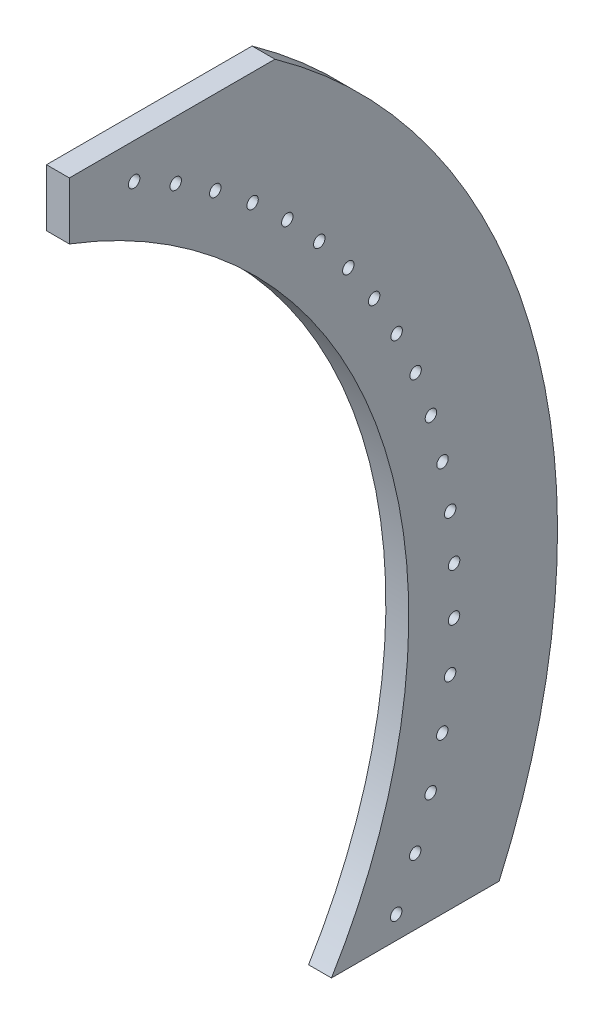
ISO-10303-21;
HEADER;
FILE_DESCRIPTION(('STEP AP214'),'2;1');
FILE_NAME('part.step','',(''),(''),'','','');
FILE_SCHEMA(('AUTOMOTIVE_DESIGN { 1 0 10303 214 1 1 1 1 }'));
ENDSEC;
DATA;
#1=APPLICATION_CONTEXT('core data for automotive mechanical design processes');
#2=APPLICATION_PROTOCOL_DEFINITION('international standard','automotive_design',2000,#1);
#3=PRODUCT_CONTEXT('',#1,'mechanical');
#4=PRODUCT('Part','Part','',(#3));
#5=PRODUCT_RELATED_PRODUCT_CATEGORY('part','',(#4));
#6=PRODUCT_DEFINITION_FORMATION('','',#4);
#7=PRODUCT_DEFINITION_CONTEXT('part definition',#1,'design');
#8=PRODUCT_DEFINITION('design','',#6,#7);
#9=PRODUCT_DEFINITION_SHAPE('','',#8);
#10=(LENGTH_UNIT() NAMED_UNIT(*) SI_UNIT(.MILLI.,.METRE.));
#11=(NAMED_UNIT(*) PLANE_ANGLE_UNIT() SI_UNIT($,.RADIAN.));
#12=(NAMED_UNIT(*) SI_UNIT($,.STERADIAN.) SOLID_ANGLE_UNIT());
#13=UNCERTAINTY_MEASURE_WITH_UNIT(LENGTH_MEASURE(1.E-05),#10,'distance_accuracy_value','');
#14=(GEOMETRIC_REPRESENTATION_CONTEXT(3) GLOBAL_UNCERTAINTY_ASSIGNED_CONTEXT((#13)) GLOBAL_UNIT_ASSIGNED_CONTEXT((#10,
#11,#12)) REPRESENTATION_CONTEXT('',''));
#15=CARTESIAN_POINT('',(0.,0.,0.));
#16=DIRECTION('',(0.,0.,1.));
#17=DIRECTION('',(1.,0.,0.));
#18=AXIS2_PLACEMENT_3D('',#15,#16,#17);
#19=CARTESIAN_POINT('',(12.7,609.6,0.));
#20=DIRECTION('',(0.,-1.,0.));
#21=DIRECTION('',(0.,0.,-1.));
#22=AXIS2_PLACEMENT_3D('',#19,#20,#21);
#23=PLANE('',#22);
#24=DIRECTION('',(1.,0.,0.));
#25=VECTOR('',#24,1.);
#26=CARTESIAN_POINT('',(0.,609.6,-114.092348386149));
#27=LINE('',#26,#25);
#28=CARTESIAN_POINT('',(0.,609.6,-114.092348386149));
#29=VERTEX_POINT('',#28);
#30=CARTESIAN_POINT('',(12.7,609.6,-114.092348386149));
#31=VERTEX_POINT('',#30);
#32=EDGE_CURVE('E91',#29,#31,#27,.T.);
#33=ORIENTED_EDGE('',*,*,#32,.F.);
#34=DIRECTION('',(0.,0.,1.));
#35=VECTOR('',#34,1.);
#36=CARTESIAN_POINT('',(0.,609.6,0.));
#37=LINE('',#36,#35);
#38=CARTESIAN_POINT('',(0.,609.6,0.));
#39=VERTEX_POINT('',#38);
#40=EDGE_CURVE('E98',#29,#39,#37,.T.);
#41=ORIENTED_EDGE('',*,*,#40,.T.);
#42=DIRECTION('',(-1.,0.,0.));
#43=VECTOR('',#42,1.);
#44=CARTESIAN_POINT('',(12.7,609.6,0.));
#45=LINE('',#44,#43);
#46=CARTESIAN_POINT('',(12.7,609.6,0.));
#47=VERTEX_POINT('',#46);
#48=EDGE_CURVE('E149',#47,#39,#45,.T.);
#49=ORIENTED_EDGE('',*,*,#48,.F.);
#50=DIRECTION('',(0.,0.,1.));
#51=VECTOR('',#50,1.);
#52=CARTESIAN_POINT('',(12.7,609.6,0.));
#53=LINE('',#52,#51);
#54=EDGE_CURVE('E152',#31,#47,#53,.T.);
#55=ORIENTED_EDGE('',*,*,#54,.F.);
#56=EDGE_LOOP('',(#33,#41,#49,#55));
#57=FACE_BOUND('',#56,.T.);
#58=ADVANCED_FACE('F38',(#57),#23,.F.);
#59=CARTESIAN_POINT('',(12.7,304.8,103.759854953638));
#60=DIRECTION('',(-1.,0.,0.));
#61=DIRECTION('',(0.,0.,1.));
#62=AXIS2_PLACEMENT_3D('',#59,#60,#61);
#63=PLANE('',#62);
#64=CARTESIAN_POINT('',(12.7,589.914292872178,-35.9401450463644));
#65=DIRECTION('',(1.,0.,0.));
#66=DIRECTION('',(0.,0.,-1.));
#67=AXIS2_PLACEMENT_3D('',#64,#65,#66);
#68=CIRCLE('',#67,3.17500000000004);
#69=CARTESIAN_POINT('',(12.7,589.914292872178,-39.1151450463645));
#70=VERTEX_POINT('',#69);
#71=EDGE_CURVE('E173',#70,#70,#68,.T.);
#72=ORIENTED_EDGE('',*,*,#71,.F.);
#73=EDGE_LOOP('',(#72));
#74=FACE_BOUND('',#73,.T.);
#75=CARTESIAN_POINT('',(12.7,577.404148448489,-59.0075504095873));
#76=DIRECTION('',(1.,0.,0.));
#77=DIRECTION('',(0.,0.,-1.));
#78=AXIS2_PLACEMENT_3D('',#75,#76,#77);
#79=CIRCLE('',#78,3.17500000000004);
#80=CARTESIAN_POINT('',(12.7,577.404148448489,-62.1825504095873));
#81=VERTEX_POINT('',#80);
#82=EDGE_CURVE('E181',#81,#81,#79,.T.);
#83=ORIENTED_EDGE('',*,*,#82,.F.);
#84=EDGE_LOOP('',(#83));
#85=FACE_BOUND('',#84,.T.);
#86=CARTESIAN_POINT('',(12.7,563.031841273928,-80.9630893502014));
#87=DIRECTION('',(1.,0.,0.));
#88=DIRECTION('',(0.,0.,-1.));
#89=AXIS2_PLACEMENT_3D('',#86,#87,#88);
#90=CIRCLE('',#89,3.17500000000004);
#91=CARTESIAN_POINT('',(12.7,563.031841273928,-84.1380893502015));
#92=VERTEX_POINT('',#91);
#93=EDGE_CURVE('E189',#92,#92,#90,.T.);
#94=ORIENTED_EDGE('',*,*,#93,.F.);
#95=EDGE_LOOP('',(#94));
#96=FACE_BOUND('',#95,.T.);
#97=CARTESIAN_POINT('',(12.7,546.895548779823,-101.656783274619));
#98=DIRECTION('',(1.,0.,0.));
#99=DIRECTION('',(0.,0.,-1.));
#100=AXIS2_PLACEMENT_3D('',#97,#98,#99);
#101=CIRCLE('',#100,3.17500000000004);
#102=CARTESIAN_POINT('',(12.7,546.895548779823,-104.831783274619));
#103=VERTEX_POINT('',#102);
#104=EDGE_CURVE('E197',#103,#103,#101,.T.);
#105=ORIENTED_EDGE('',*,*,#104,.F.);
#106=EDGE_LOOP('',(#105));
#107=FACE_BOUND('',#106,.T.);
#108=CARTESIAN_POINT('',(12.7,529.105498205895,-120.947273270207));
#109=DIRECTION('',(1.,0.,0.));
#110=DIRECTION('',(0.,0.,-1.));
#111=AXIS2_PLACEMENT_3D('',#108,#109,#110);
#112=CIRCLE('',#111,3.17500000000004);
#113=CARTESIAN_POINT('',(12.7,529.105498205895,-124.122273270207));
#114=VERTEX_POINT('',#113);
#115=EDGE_CURVE('E205',#114,#114,#112,.T.);
#116=ORIENTED_EDGE('',*,*,#115,.F.);
#117=EDGE_LOOP('',(#116));
#118=FACE_BOUND('',#117,.T.);
#119=CARTESIAN_POINT('',(12.7,509.783213636438,-138.702785729995));
#120=DIRECTION('',(1.,0.,0.));
#121=DIRECTION('',(0.,0.,-1.));
#122=AXIS2_PLACEMENT_3D('',#119,#120,#121);
#123=CIRCLE('',#122,3.17500000000004);
#124=CARTESIAN_POINT('',(12.7,509.783213636438,-141.877785729995));
#125=VERTEX_POINT('',#124);
#126=EDGE_CURVE('E213',#125,#125,#123,.T.);
#127=ORIENTED_EDGE('',*,*,#126,.F.);
#128=EDGE_LOOP('',(#127));
#129=FACE_BOUND('',#128,.T.);
#130=CARTESIAN_POINT('',(12.7,489.0606858676,-154.802032500031));
#131=DIRECTION('',(1.,0.,0.));
#132=DIRECTION('',(0.,0.,-1.));
#133=AXIS2_PLACEMENT_3D('',#130,#131,#132);
#134=CIRCLE('',#133,3.17499999999998);
#135=CARTESIAN_POINT('',(12.7,489.0606858676,-157.977032500031));
#136=VERTEX_POINT('',#135);
#137=EDGE_CURVE('E221',#136,#136,#134,.T.);
#138=ORIENTED_EDGE('',*,*,#137,.F.);
#139=EDGE_LOOP('',(#138));
#140=FACE_BOUND('',#139,.T.);
#141=CARTESIAN_POINT('',(12.7,467.079470776408,-169.135039400454));
#142=DIRECTION('',(1.,0.,0.));
#143=DIRECTION('',(0.,0.,-1.));
#144=AXIS2_PLACEMENT_3D('',#141,#142,#143);
#145=CIRCLE('',#144,3.17499999999998);
#146=CARTESIAN_POINT('',(12.7,467.079470776408,-172.310039400454));
#147=VERTEX_POINT('',#146);
#148=EDGE_CURVE('E229',#147,#147,#145,.T.);
#149=ORIENTED_EDGE('',*,*,#148,.F.);
#150=EDGE_LOOP('',(#149));
#151=FACE_BOUND('',#150,.T.);
#152=CARTESIAN_POINT('',(12.7,443.989722350595,-181.603897460655));
#153=DIRECTION('',(1.,0.,0.));
#154=DIRECTION('',(0.,0.,-1.));
#155=AXIS2_PLACEMENT_3D('',#152,#153,#154);
#156=CIRCLE('',#155,3.17499999999998);
#157=CARTESIAN_POINT('',(12.7,443.989722350595,-184.778897460655));
#158=VERTEX_POINT('',#157);
#159=EDGE_CURVE('E237',#158,#158,#156,.T.);
#160=ORIENTED_EDGE('',*,*,#159,.F.);
#161=EDGE_LOOP('',(#160));
#162=FACE_BOUND('',#161,.T.);
#163=CARTESIAN_POINT('',(12.7,419.949166984606,-192.123431736829));
#164=DIRECTION('',(1.,0.,0.));
#165=DIRECTION('',(0.,0.,-1.));
#166=AXIS2_PLACEMENT_3D('',#163,#164,#165);
#167=CIRCLE('',#166,3.17499999999998);
#168=CARTESIAN_POINT('',(12.7,419.949166984606,-195.298431736829));
#169=VERTEX_POINT('',#168);
#170=EDGE_CURVE('E245',#169,#169,#167,.T.);
#171=ORIENTED_EDGE('',*,*,#170,.F.);
#172=EDGE_LOOP('',(#171));
#173=FACE_BOUND('',#172,.T.);
#174=CARTESIAN_POINT('',(12.7,395.122026048393,-200.621783143201));
#175=DIRECTION('',(1.,0.,0.));
#176=DIRECTION('',(0.,0.,-1.));
#177=AXIS2_PLACEMENT_3D('',#174,#175,#176);
#178=CIRCLE('',#177,3.17499999999998);
#179=CARTESIAN_POINT('',(12.7,395.122026048393,-203.796783143201));
#180=VERTEX_POINT('',#179);
#181=EDGE_CURVE('E253',#180,#180,#178,.T.);
#182=ORIENTED_EDGE('',*,*,#181,.F.);
#183=EDGE_LOOP('',(#182));
#184=FACE_BOUND('',#183,.T.);
#185=CARTESIAN_POINT('',(12.7,369.677894088939,-207.040899322451));
#186=DIRECTION('',(1.,0.,0.));
#187=DIRECTION('',(0.,0.,-1.));
#188=AXIS2_PLACEMENT_3D('',#185,#186,#187);
#189=CIRCLE('',#188,3.17499999999998);
#190=CARTESIAN_POINT('',(12.7,369.677894088939,-210.215899322451));
#191=VERTEX_POINT('',#190);
#192=EDGE_CURVE('E261',#191,#191,#189,.T.);
#193=ORIENTED_EDGE('',*,*,#192,.F.);
#194=EDGE_LOOP('',(#193));
#195=FACE_BOUND('',#194,.T.);
#196=CARTESIAN_POINT('',(12.7,343.790580327539,-211.336931202176));
#197=DIRECTION('',(1.,0.,0.));
#198=DIRECTION('',(0.,0.,-1.));
#199=AXIS2_PLACEMENT_3D('',#196,#197,#198);
#200=CIRCLE('',#199,3.17499999999998);
#201=CARTESIAN_POINT('',(12.7,343.790580327539,-214.511931202176));
#202=VERTEX_POINT('',#201);
#203=EDGE_CURVE('E269',#202,#202,#200,.T.);
#204=ORIENTED_EDGE('',*,*,#203,.F.);
#205=EDGE_LOOP('',(#204));
#206=FACE_BOUND('',#205,.T.);
#207=CARTESIAN_POINT('',(12.7,317.636921366574,-213.480532528519));
#208=DIRECTION('',(1.,0.,0.));
#209=DIRECTION('',(0.,0.,-1.));
#210=AXIS2_PLACEMENT_3D('',#207,#208,#209);
#211=CIRCLE('',#210,3.17499999999998);
#212=CARTESIAN_POINT('',(12.7,317.636921366574,-216.655532528519));
#213=VERTEX_POINT('',#212);
#214=EDGE_CURVE('E277',#213,#213,#211,.T.);
#215=ORIENTED_EDGE('',*,*,#214,.F.);
#216=EDGE_LOOP('',(#215));
#217=FACE_BOUND('',#216,.T.);
#218=CARTESIAN_POINT('',(12.7,291.395573216208,-213.457060330839));
#219=DIRECTION('',(1.,0.,0.));
#220=DIRECTION('',(0.,0.,-1.));
#221=AXIS2_PLACEMENT_3D('',#218,#219,#220);
#222=CIRCLE('',#221,3.17499999999998);
#223=CARTESIAN_POINT('',(12.7,291.395573216208,-216.632060330839));
#224=VERTEX_POINT('',#223);
#225=EDGE_CURVE('E285',#224,#224,#222,.T.);
#226=ORIENTED_EDGE('',*,*,#225,.F.);
#227=EDGE_LOOP('',(#226));
#228=FACE_BOUND('',#227,.T.);
#229=CARTESIAN_POINT('',(12.7,265.245790892685,-211.266674948044));
#230=DIRECTION('',(1.,0.,0.));
#231=DIRECTION('',(0.,0.,-1.));
#232=AXIS2_PLACEMENT_3D('',#229,#230,#231);
#233=CIRCLE('',#232,3.17499999999998);
#234=CARTESIAN_POINT('',(12.7,265.245790892685,-214.441674948044));
#235=VERTEX_POINT('',#234);
#236=EDGE_CURVE('E293',#235,#235,#233,.T.);
#237=ORIENTED_EDGE('',*,*,#236,.F.);
#238=EDGE_LOOP('',(#237));
#239=FACE_BOUND('',#238,.T.);
#240=CARTESIAN_POINT('',(12.7,239.366203924806,-206.924338933322));
#241=DIRECTION('',(1.,0.,0.));
#242=DIRECTION('',(0.,0.,-1.));
#243=AXIS2_PLACEMENT_3D('',#240,#241,#242);
#244=CIRCLE('',#243,3.17500000000001);
#245=CARTESIAN_POINT('',(12.7,239.366203924806,-210.099338933322));
#246=VERTEX_POINT('',#245);
#247=EDGE_CURVE('E301',#246,#246,#244,.T.);
#248=ORIENTED_EDGE('',*,*,#247,.F.);
#249=EDGE_LOOP('',(#248));
#250=FACE_BOUND('',#249,.T.);
#251=CARTESIAN_POINT('',(12.7,213.933596133116,-200.459714844725));
#252=DIRECTION('',(1.,0.,0.));
#253=DIRECTION('',(0.,0.,-1.));
#254=AXIS2_PLACEMENT_3D('',#251,#252,#253);
#255=CIRCLE('',#254,3.17500000000001);
#256=CARTESIAN_POINT('',(12.7,213.933596133116,-203.634714844725));
#257=VERTEX_POINT('',#256);
#258=EDGE_CURVE('E309',#257,#257,#255,.T.);
#259=ORIENTED_EDGE('',*,*,#258,.F.);
#260=EDGE_LOOP('',(#259));
#261=FACE_BOUND('',#260,.T.);
#262=CARTESIAN_POINT('',(12.7,189.121698017159,-191.916962619818));
#263=DIRECTION('',(1.,0.,0.));
#264=DIRECTION('',(0.,0.,-1.));
#265=AXIS2_PLACEMENT_3D('',#262,#263,#264);
#266=CIRCLE('',#265,3.17500000000001);
#267=CARTESIAN_POINT('',(12.7,189.121698017159,-195.091962619818));
#268=VERTEX_POINT('',#267);
#269=EDGE_CURVE('E317',#268,#268,#266,.T.);
#270=ORIENTED_EDGE('',*,*,#269,.F.);
#271=EDGE_LOOP('',(#270));
#272=FACE_BOUND('',#271,.T.);
#273=CARTESIAN_POINT('',(12.7,165.1,-181.354437918536));
#274=DIRECTION('',(1.,0.,0.));
#275=DIRECTION('',(0.,0.,-1.));
#276=AXIS2_PLACEMENT_3D('',#273,#274,#275);
#277=CIRCLE('',#276,3.17500000000001);
#278=CARTESIAN_POINT('',(12.7,165.1,-184.529437918536));
#279=VERTEX_POINT('',#278);
#280=EDGE_CURVE('E90',#279,#279,#277,.T.);
#281=ORIENTED_EDGE('',*,*,#280,.F.);
#282=EDGE_LOOP('',(#281));
#283=FACE_BOUND('',#282,.T.);
#284=CARTESIAN_POINT('',(12.7,304.8,103.759854953638));
#285=DIRECTION('',(1.,0.,0.));
#286=DIRECTION('',(0.,0.,-1.));
#287=AXIS2_PLACEMENT_3D('',#284,#285,#286);
#288=CIRCLE('',#287,374.65);
#289=CARTESIAN_POINT('',(12.7,152.4,-238.492774692943));
#290=VERTEX_POINT('',#289);
#291=EDGE_CURVE('E54',#290,#31,#288,.T.);
#292=ORIENTED_EDGE('',*,*,#291,.T.);
#293=ORIENTED_EDGE('',*,*,#54,.T.);
#294=DIRECTION('',(0.,-1.,0.));
#295=VECTOR('',#294,1.);
#296=CARTESIAN_POINT('',(12.7,609.6,0.));
#297=LINE('',#296,#295);
#298=CARTESIAN_POINT('',(12.7,577.85,0.));
#299=VERTEX_POINT('',#298);
#300=EDGE_CURVE('E144',#47,#299,#297,.T.);
#301=ORIENTED_EDGE('',*,*,#300,.T.);
#302=CARTESIAN_POINT('',(12.7,304.8,103.759854953638));
#303=DIRECTION('',(-1.,0.,0.));
#304=DIRECTION('',(0.,0.,1.));
#305=AXIS2_PLACEMENT_3D('',#302,#303,#304);
#306=CIRCLE('',#305,292.1);
#307=CARTESIAN_POINT('',(12.7,152.4,-145.432139299789));
#308=VERTEX_POINT('',#307);
#309=EDGE_CURVE('E156',#299,#308,#306,.T.);
#310=ORIENTED_EDGE('',*,*,#309,.T.);
#311=DIRECTION('',(0.,0.,1.));
#312=VECTOR('',#311,1.);
#313=CARTESIAN_POINT('',(12.7,152.4,233.500231465649));
#314=LINE('',#313,#312);
#315=EDGE_CURVE('E166',#290,#308,#314,.T.);
#316=ORIENTED_EDGE('',*,*,#315,.F.);
#317=EDGE_LOOP('',(#292,#293,#301,#310,#316));
#318=FACE_BOUND('',#317,.T.);
#319=ADVANCED_FACE('F111',(#74,#85,#96,#107,#118,#129,#140,#151,#162,#173,#184,#195,#206,#217,
#228,#239,#250,#261,#272,#283,#318),#63,.F.);
#320=CARTESIAN_POINT('',(0.,304.8,103.759854953638));
#321=DIRECTION('',(-1.,0.,0.));
#322=DIRECTION('',(0.,0.,1.));
#323=AXIS2_PLACEMENT_3D('',#320,#321,#322);
#324=PLANE('',#323);
#325=CARTESIAN_POINT('',(0.,165.1,-181.354437918536));
#326=DIRECTION('',(1.,0.,0.));
#327=DIRECTION('',(0.,0.,-1.));
#328=AXIS2_PLACEMENT_3D('',#325,#326,#327);
#329=CIRCLE('',#328,3.17499999999998);
#330=CARTESIAN_POINT('',(0.,165.1,-184.529437918536));
#331=VERTEX_POINT('',#330);
#332=EDGE_CURVE('E321',#331,#331,#329,.T.);
#333=ORIENTED_EDGE('',*,*,#332,.T.);
#334=EDGE_LOOP('',(#333));
#335=FACE_BOUND('',#334,.T.);
#336=CARTESIAN_POINT('',(0.,189.121698017159,-191.916962619818));
#337=DIRECTION('',(1.,0.,0.));
#338=DIRECTION('',(0.,0.,-1.));
#339=AXIS2_PLACEMENT_3D('',#336,#337,#338);
#340=CIRCLE('',#339,3.17499999999998);
#341=CARTESIAN_POINT('',(0.,189.121698017159,-195.091962619818));
#342=VERTEX_POINT('',#341);
#343=EDGE_CURVE('E313',#342,#342,#340,.T.);
#344=ORIENTED_EDGE('',*,*,#343,.T.);
#345=EDGE_LOOP('',(#344));
#346=FACE_BOUND('',#345,.T.);
#347=CARTESIAN_POINT('',(0.,213.933596133116,-200.459714844725));
#348=DIRECTION('',(1.,0.,0.));
#349=DIRECTION('',(0.,0.,-1.));
#350=AXIS2_PLACEMENT_3D('',#347,#348,#349);
#351=CIRCLE('',#350,3.17499999999998);
#352=CARTESIAN_POINT('',(0.,213.933596133116,-203.634714844725));
#353=VERTEX_POINT('',#352);
#354=EDGE_CURVE('E305',#353,#353,#351,.T.);
#355=ORIENTED_EDGE('',*,*,#354,.T.);
#356=EDGE_LOOP('',(#355));
#357=FACE_BOUND('',#356,.T.);
#358=CARTESIAN_POINT('',(0.,239.366203924806,-206.924338933322));
#359=DIRECTION('',(1.,0.,0.));
#360=DIRECTION('',(0.,0.,-1.));
#361=AXIS2_PLACEMENT_3D('',#358,#359,#360);
#362=CIRCLE('',#361,3.17499999999998);
#363=CARTESIAN_POINT('',(0.,239.366203924806,-210.099338933322));
#364=VERTEX_POINT('',#363);
#365=EDGE_CURVE('E297',#364,#364,#362,.T.);
#366=ORIENTED_EDGE('',*,*,#365,.T.);
#367=EDGE_LOOP('',(#366));
#368=FACE_BOUND('',#367,.T.);
#369=CARTESIAN_POINT('',(0.,265.245790892685,-211.266674948044));
#370=DIRECTION('',(1.,0.,0.));
#371=DIRECTION('',(0.,0.,-1.));
#372=AXIS2_PLACEMENT_3D('',#369,#370,#371);
#373=CIRCLE('',#372,3.17499999999998);
#374=CARTESIAN_POINT('',(0.,265.245790892685,-214.441674948044));
#375=VERTEX_POINT('',#374);
#376=EDGE_CURVE('E289',#375,#375,#373,.T.);
#377=ORIENTED_EDGE('',*,*,#376,.T.);
#378=EDGE_LOOP('',(#377));
#379=FACE_BOUND('',#378,.T.);
#380=CARTESIAN_POINT('',(0.,291.395573216208,-213.457060330839));
#381=DIRECTION('',(1.,0.,0.));
#382=DIRECTION('',(0.,0.,-1.));
#383=AXIS2_PLACEMENT_3D('',#380,#381,#382);
#384=CIRCLE('',#383,3.17499999999998);
#385=CARTESIAN_POINT('',(0.,291.395573216208,-216.632060330839));
#386=VERTEX_POINT('',#385);
#387=EDGE_CURVE('E281',#386,#386,#384,.T.);
#388=ORIENTED_EDGE('',*,*,#387,.T.);
#389=EDGE_LOOP('',(#388));
#390=FACE_BOUND('',#389,.T.);
#391=CARTESIAN_POINT('',(0.,317.636921366574,-213.480532528519));
#392=DIRECTION('',(1.,0.,0.));
#393=DIRECTION('',(0.,0.,-1.));
#394=AXIS2_PLACEMENT_3D('',#391,#392,#393);
#395=CIRCLE('',#394,3.17499999999998);
#396=CARTESIAN_POINT('',(0.,317.636921366574,-216.655532528519));
#397=VERTEX_POINT('',#396);
#398=EDGE_CURVE('E273',#397,#397,#395,.T.);
#399=ORIENTED_EDGE('',*,*,#398,.T.);
#400=EDGE_LOOP('',(#399));
#401=FACE_BOUND('',#400,.T.);
#402=CARTESIAN_POINT('',(0.,343.790580327539,-211.336931202176));
#403=DIRECTION('',(1.,0.,0.));
#404=DIRECTION('',(0.,0.,-1.));
#405=AXIS2_PLACEMENT_3D('',#402,#403,#404);
#406=CIRCLE('',#405,3.17499999999998);
#407=CARTESIAN_POINT('',(0.,343.790580327539,-214.511931202176));
#408=VERTEX_POINT('',#407);
#409=EDGE_CURVE('E265',#408,#408,#406,.T.);
#410=ORIENTED_EDGE('',*,*,#409,.T.);
#411=EDGE_LOOP('',(#410));
#412=FACE_BOUND('',#411,.T.);
#413=CARTESIAN_POINT('',(0.,369.677894088939,-207.040899322451));
#414=DIRECTION('',(1.,0.,0.));
#415=DIRECTION('',(0.,0.,-1.));
#416=AXIS2_PLACEMENT_3D('',#413,#414,#415);
#417=CIRCLE('',#416,3.17499999999998);
#418=CARTESIAN_POINT('',(0.,369.677894088939,-210.215899322451));
#419=VERTEX_POINT('',#418);
#420=EDGE_CURVE('E257',#419,#419,#417,.T.);
#421=ORIENTED_EDGE('',*,*,#420,.T.);
#422=EDGE_LOOP('',(#421));
#423=FACE_BOUND('',#422,.T.);
#424=CARTESIAN_POINT('',(0.,395.122026048393,-200.621783143201));
#425=DIRECTION('',(1.,0.,0.));
#426=DIRECTION('',(0.,0.,-1.));
#427=AXIS2_PLACEMENT_3D('',#424,#425,#426);
#428=CIRCLE('',#427,3.17499999999998);
#429=CARTESIAN_POINT('',(0.,395.122026048393,-203.796783143201));
#430=VERTEX_POINT('',#429);
#431=EDGE_CURVE('E249',#430,#430,#428,.T.);
#432=ORIENTED_EDGE('',*,*,#431,.T.);
#433=EDGE_LOOP('',(#432));
#434=FACE_BOUND('',#433,.T.);
#435=CARTESIAN_POINT('',(0.,419.949166984606,-192.123431736829));
#436=DIRECTION('',(1.,0.,0.));
#437=DIRECTION('',(0.,0.,-1.));
#438=AXIS2_PLACEMENT_3D('',#435,#436,#437);
#439=CIRCLE('',#438,3.17499999999998);
#440=CARTESIAN_POINT('',(0.,419.949166984606,-195.298431736829));
#441=VERTEX_POINT('',#440);
#442=EDGE_CURVE('E241',#441,#441,#439,.T.);
#443=ORIENTED_EDGE('',*,*,#442,.T.);
#444=EDGE_LOOP('',(#443));
#445=FACE_BOUND('',#444,.T.);
#446=CARTESIAN_POINT('',(0.,443.989722350595,-181.603897460655));
#447=DIRECTION('',(1.,0.,0.));
#448=DIRECTION('',(0.,0.,-1.));
#449=AXIS2_PLACEMENT_3D('',#446,#447,#448);
#450=CIRCLE('',#449,3.17499999999998);
#451=CARTESIAN_POINT('',(0.,443.989722350595,-184.778897460655));
#452=VERTEX_POINT('',#451);
#453=EDGE_CURVE('E233',#452,#452,#450,.T.);
#454=ORIENTED_EDGE('',*,*,#453,.T.);
#455=EDGE_LOOP('',(#454));
#456=FACE_BOUND('',#455,.T.);
#457=CARTESIAN_POINT('',(0.,467.079470776408,-169.135039400454));
#458=DIRECTION('',(1.,0.,0.));
#459=DIRECTION('',(0.,0.,-1.));
#460=AXIS2_PLACEMENT_3D('',#457,#458,#459);
#461=CIRCLE('',#460,3.17499999999998);
#462=CARTESIAN_POINT('',(0.,467.079470776408,-172.310039400454));
#463=VERTEX_POINT('',#462);
#464=EDGE_CURVE('E225',#463,#463,#461,.T.);
#465=ORIENTED_EDGE('',*,*,#464,.T.);
#466=EDGE_LOOP('',(#465));
#467=FACE_BOUND('',#466,.T.);
#468=CARTESIAN_POINT('',(0.,489.0606858676,-154.802032500031));
#469=DIRECTION('',(1.,0.,0.));
#470=DIRECTION('',(0.,0.,-1.));
#471=AXIS2_PLACEMENT_3D('',#468,#469,#470);
#472=CIRCLE('',#471,3.17499999999998);
#473=CARTESIAN_POINT('',(0.,489.0606858676,-157.977032500031));
#474=VERTEX_POINT('',#473);
#475=EDGE_CURVE('E217',#474,#474,#472,.T.);
#476=ORIENTED_EDGE('',*,*,#475,.T.);
#477=EDGE_LOOP('',(#476));
#478=FACE_BOUND('',#477,.T.);
#479=CARTESIAN_POINT('',(0.,509.783213636438,-138.702785729995));
#480=DIRECTION('',(1.,0.,0.));
#481=DIRECTION('',(0.,0.,-1.));
#482=AXIS2_PLACEMENT_3D('',#479,#480,#481);
#483=CIRCLE('',#482,3.17500000000004);
#484=CARTESIAN_POINT('',(0.,509.783213636438,-141.877785729995));
#485=VERTEX_POINT('',#484);
#486=EDGE_CURVE('E209',#485,#485,#483,.T.);
#487=ORIENTED_EDGE('',*,*,#486,.T.);
#488=EDGE_LOOP('',(#487));
#489=FACE_BOUND('',#488,.T.);
#490=CARTESIAN_POINT('',(0.,529.105498205895,-120.947273270207));
#491=DIRECTION('',(1.,0.,0.));
#492=DIRECTION('',(0.,0.,-1.));
#493=AXIS2_PLACEMENT_3D('',#490,#491,#492);
#494=CIRCLE('',#493,3.17500000000004);
#495=CARTESIAN_POINT('',(0.,529.105498205895,-124.122273270207));
#496=VERTEX_POINT('',#495);
#497=EDGE_CURVE('E201',#496,#496,#494,.T.);
#498=ORIENTED_EDGE('',*,*,#497,.T.);
#499=EDGE_LOOP('',(#498));
#500=FACE_BOUND('',#499,.T.);
#501=CARTESIAN_POINT('',(0.,546.895548779823,-101.656783274619));
#502=DIRECTION('',(1.,0.,0.));
#503=DIRECTION('',(0.,0.,-1.));
#504=AXIS2_PLACEMENT_3D('',#501,#502,#503);
#505=CIRCLE('',#504,3.17500000000004);
#506=CARTESIAN_POINT('',(0.,546.895548779823,-104.831783274619));
#507=VERTEX_POINT('',#506);
#508=EDGE_CURVE('E193',#507,#507,#505,.T.);
#509=ORIENTED_EDGE('',*,*,#508,.T.);
#510=EDGE_LOOP('',(#509));
#511=FACE_BOUND('',#510,.T.);
#512=CARTESIAN_POINT('',(0.,563.031841273928,-80.9630893502014));
#513=DIRECTION('',(1.,0.,0.));
#514=DIRECTION('',(0.,0.,-1.));
#515=AXIS2_PLACEMENT_3D('',#512,#513,#514);
#516=CIRCLE('',#515,3.17500000000004);
#517=CARTESIAN_POINT('',(0.,563.031841273928,-84.1380893502015));
#518=VERTEX_POINT('',#517);
#519=EDGE_CURVE('E185',#518,#518,#516,.T.);
#520=ORIENTED_EDGE('',*,*,#519,.T.);
#521=EDGE_LOOP('',(#520));
#522=FACE_BOUND('',#521,.T.);
#523=CARTESIAN_POINT('',(0.,577.404148448489,-59.0075504095873));
#524=DIRECTION('',(1.,0.,0.));
#525=DIRECTION('',(0.,0.,-1.));
#526=AXIS2_PLACEMENT_3D('',#523,#524,#525);
#527=CIRCLE('',#526,3.17500000000004);
#528=CARTESIAN_POINT('',(0.,577.404148448489,-62.1825504095873));
#529=VERTEX_POINT('',#528);
#530=EDGE_CURVE('E177',#529,#529,#527,.T.);
#531=ORIENTED_EDGE('',*,*,#530,.T.);
#532=EDGE_LOOP('',(#531));
#533=FACE_BOUND('',#532,.T.);
#534=CARTESIAN_POINT('',(0.,589.914292872178,-35.9401450463644));
#535=DIRECTION('',(1.,0.,0.));
#536=DIRECTION('',(0.,0.,-1.));
#537=AXIS2_PLACEMENT_3D('',#534,#535,#536);
#538=CIRCLE('',#537,3.17500000000004);
#539=CARTESIAN_POINT('',(0.,589.914292872178,-39.1151450463645));
#540=VERTEX_POINT('',#539);
#541=EDGE_CURVE('E169',#540,#540,#538,.T.);
#542=ORIENTED_EDGE('',*,*,#541,.T.);
#543=EDGE_LOOP('',(#542));
#544=FACE_BOUND('',#543,.T.);
#545=ORIENTED_EDGE('',*,*,#40,.F.);
#546=CARTESIAN_POINT('',(0.,304.8,103.759854953638));
#547=DIRECTION('',(1.,0.,0.));
#548=DIRECTION('',(0.,0.,-1.));
#549=AXIS2_PLACEMENT_3D('',#546,#547,#548);
#550=CIRCLE('',#549,374.65);
#551=CARTESIAN_POINT('',(0.,152.4,-238.492774692943));
#552=VERTEX_POINT('',#551);
#553=EDGE_CURVE('E86',#552,#29,#550,.T.);
#554=ORIENTED_EDGE('',*,*,#553,.F.);
#555=DIRECTION('',(0.,0.,-1.));
#556=VECTOR('',#555,1.);
#557=CARTESIAN_POINT('',(0.,152.4,103.759854953638));
#558=LINE('',#557,#556);
#559=CARTESIAN_POINT('',(0.,152.4,-145.432139299789));
#560=VERTEX_POINT('',#559);
#561=EDGE_CURVE('E11',#560,#552,#558,.T.);
#562=ORIENTED_EDGE('',*,*,#561,.F.);
#563=CARTESIAN_POINT('',(0.,304.8,103.759854953638));
#564=DIRECTION('',(-1.,0.,0.));
#565=DIRECTION('',(0.,0.,1.));
#566=AXIS2_PLACEMENT_3D('',#563,#564,#565);
#567=CIRCLE('',#566,292.1);
#568=CARTESIAN_POINT('',(0.,577.85,0.));
#569=VERTEX_POINT('',#568);
#570=EDGE_CURVE('E135',#569,#560,#567,.T.);
#571=ORIENTED_EDGE('',*,*,#570,.F.);
#572=DIRECTION('',(0.,-1.,0.));
#573=VECTOR('',#572,1.);
#574=CARTESIAN_POINT('',(0.,609.6,0.));
#575=LINE('',#574,#573);
#576=EDGE_CURVE('E140',#39,#569,#575,.T.);
#577=ORIENTED_EDGE('',*,*,#576,.F.);
#578=EDGE_LOOP('',(#545,#554,#562,#571,#577));
#579=FACE_BOUND('',#578,.T.);
#580=ADVANCED_FACE('F95',(#335,#346,#357,#368,#379,#390,#401,#412,#423,#434,#445,#456,#467,#478,
#489,#500,#511,#522,#533,#544,#579),#324,.T.);
#581=CARTESIAN_POINT('',(0.,152.4,233.500231465649));
#582=DIRECTION('',(0.,1.,0.));
#583=DIRECTION('',(0.,0.,1.));
#584=AXIS2_PLACEMENT_3D('',#581,#582,#583);
#585=PLANE('',#584);
#586=DIRECTION('',(1.,0.,0.));
#587=VECTOR('',#586,1.);
#588=CARTESIAN_POINT('',(0.,152.4,-238.492774692943));
#589=LINE('',#588,#587);
#590=EDGE_CURVE('E83',#552,#290,#589,.T.);
#591=ORIENTED_EDGE('',*,*,#590,.T.);
#592=ORIENTED_EDGE('',*,*,#315,.T.);
#593=DIRECTION('',(-1.,0.,0.));
#594=VECTOR('',#593,1.);
#595=CARTESIAN_POINT('',(12.7,152.4,-145.432139299789));
#596=LINE('',#595,#594);
#597=EDGE_CURVE('E61',#560,#308,#596,.F.);
#598=ORIENTED_EDGE('',*,*,#597,.F.);
#599=ORIENTED_EDGE('',*,*,#561,.T.);
#600=EDGE_LOOP('',(#591,#592,#598,#599));
#601=FACE_BOUND('',#600,.T.);
#602=ADVANCED_FACE('F101',(#601),#585,.F.);
#603=CARTESIAN_POINT('',(12.7,609.6,0.));
#604=DIRECTION('',(0.,0.,-1.));
#605=DIRECTION('',(-1.,0.,0.));
#606=AXIS2_PLACEMENT_3D('',#603,#604,#605);
#607=PLANE('',#606);
#608=ORIENTED_EDGE('',*,*,#576,.T.);
#609=DIRECTION('',(-1.,0.,0.));
#610=VECTOR('',#609,1.);
#611=CARTESIAN_POINT('',(12.7,577.85,0.));
#612=LINE('',#611,#610);
#613=EDGE_CURVE('E47',#299,#569,#612,.T.);
#614=ORIENTED_EDGE('',*,*,#613,.F.);
#615=ORIENTED_EDGE('',*,*,#300,.F.);
#616=ORIENTED_EDGE('',*,*,#48,.T.);
#617=EDGE_LOOP('',(#608,#614,#615,#616));
#618=FACE_BOUND('',#617,.T.);
#619=ADVANCED_FACE('F40',(#618),#607,.F.);
#620=CARTESIAN_POINT('',(12.7,304.8,103.759854953638));
#621=DIRECTION('',(-1.,0.,0.));
#622=DIRECTION('',(0.,0.,1.));
#623=AXIS2_PLACEMENT_3D('',#620,#621,#622);
#624=CYLINDRICAL_SURFACE('',#623,292.1);
#625=ORIENTED_EDGE('',*,*,#570,.T.);
#626=ORIENTED_EDGE('',*,*,#597,.T.);
#627=ORIENTED_EDGE('',*,*,#309,.F.);
#628=ORIENTED_EDGE('',*,*,#613,.T.);
#629=EDGE_LOOP('',(#625,#626,#627,#628));
#630=FACE_BOUND('',#629,.T.);
#631=ADVANCED_FACE('F109',(#630),#624,.F.);
#632=CARTESIAN_POINT('',(12.7,589.914292872178,-35.9401450463644));
#633=DIRECTION('',(1.,0.,0.));
#634=DIRECTION('',(0.,0.,-1.));
#635=AXIS2_PLACEMENT_3D('',#632,#633,#634);
#636=CYLINDRICAL_SURFACE('',#635,3.17500000000004);
#637=ORIENTED_EDGE('',*,*,#541,.F.);
#638=EDGE_LOOP('',(#637));
#639=FACE_BOUND('',#638,.T.);
#640=ORIENTED_EDGE('',*,*,#71,.T.);
#641=EDGE_LOOP('',(#640));
#642=FACE_BOUND('',#641,.T.);
#643=ADVANCED_FACE('F125',(#639,#642),#636,.F.);
#644=CARTESIAN_POINT('',(12.7,577.404148448489,-59.0075504095873));
#645=DIRECTION('',(1.,0.,0.));
#646=DIRECTION('',(0.,0.,-1.));
#647=AXIS2_PLACEMENT_3D('',#644,#645,#646);
#648=CYLINDRICAL_SURFACE('',#647,3.17500000000004);
#649=ORIENTED_EDGE('',*,*,#530,.F.);
#650=EDGE_LOOP('',(#649));
#651=FACE_BOUND('',#650,.T.);
#652=ORIENTED_EDGE('',*,*,#82,.T.);
#653=EDGE_LOOP('',(#652));
#654=FACE_BOUND('',#653,.T.);
#655=ADVANCED_FACE('F132',(#651,#654),#648,.F.);
#656=CARTESIAN_POINT('',(12.7,563.031841273928,-80.9630893502014));
#657=DIRECTION('',(1.,0.,0.));
#658=DIRECTION('',(0.,0.,-1.));
#659=AXIS2_PLACEMENT_3D('',#656,#657,#658);
#660=CYLINDRICAL_SURFACE('',#659,3.17500000000004);
#661=ORIENTED_EDGE('',*,*,#519,.F.);
#662=EDGE_LOOP('',(#661));
#663=FACE_BOUND('',#662,.T.);
#664=ORIENTED_EDGE('',*,*,#93,.T.);
#665=EDGE_LOOP('',(#664));
#666=FACE_BOUND('',#665,.T.);
#667=ADVANCED_FACE('F408',(#663,#666),#660,.F.);
#668=CARTESIAN_POINT('',(12.7,546.895548779823,-101.656783274619));
#669=DIRECTION('',(1.,0.,0.));
#670=DIRECTION('',(0.,0.,-1.));
#671=AXIS2_PLACEMENT_3D('',#668,#669,#670);
#672=CYLINDRICAL_SURFACE('',#671,3.17500000000004);
#673=ORIENTED_EDGE('',*,*,#508,.F.);
#674=EDGE_LOOP('',(#673));
#675=FACE_BOUND('',#674,.T.);
#676=ORIENTED_EDGE('',*,*,#104,.T.);
#677=EDGE_LOOP('',(#676));
#678=FACE_BOUND('',#677,.T.);
#679=ADVANCED_FACE('F404',(#675,#678),#672,.F.);
#680=CARTESIAN_POINT('',(12.7,529.105498205895,-120.947273270207));
#681=DIRECTION('',(1.,0.,0.));
#682=DIRECTION('',(0.,0.,-1.));
#683=AXIS2_PLACEMENT_3D('',#680,#681,#682);
#684=CYLINDRICAL_SURFACE('',#683,3.17500000000004);
#685=ORIENTED_EDGE('',*,*,#497,.F.);
#686=EDGE_LOOP('',(#685));
#687=FACE_BOUND('',#686,.T.);
#688=ORIENTED_EDGE('',*,*,#115,.T.);
#689=EDGE_LOOP('',(#688));
#690=FACE_BOUND('',#689,.T.);
#691=ADVANCED_FACE('F400',(#687,#690),#684,.F.);
#692=CARTESIAN_POINT('',(12.7,509.783213636438,-138.702785729995));
#693=DIRECTION('',(1.,0.,0.));
#694=DIRECTION('',(0.,0.,-1.));
#695=AXIS2_PLACEMENT_3D('',#692,#693,#694);
#696=CYLINDRICAL_SURFACE('',#695,3.17500000000004);
#697=ORIENTED_EDGE('',*,*,#486,.F.);
#698=EDGE_LOOP('',(#697));
#699=FACE_BOUND('',#698,.T.);
#700=ORIENTED_EDGE('',*,*,#126,.T.);
#701=EDGE_LOOP('',(#700));
#702=FACE_BOUND('',#701,.T.);
#703=ADVANCED_FACE('F396',(#699,#702),#696,.F.);
#704=CARTESIAN_POINT('',(12.7,489.0606858676,-154.802032500031));
#705=DIRECTION('',(1.,0.,0.));
#706=DIRECTION('',(0.,0.,-1.));
#707=AXIS2_PLACEMENT_3D('',#704,#705,#706);
#708=CYLINDRICAL_SURFACE('',#707,3.17499999999998);
#709=ORIENTED_EDGE('',*,*,#475,.F.);
#710=EDGE_LOOP('',(#709));
#711=FACE_BOUND('',#710,.T.);
#712=ORIENTED_EDGE('',*,*,#137,.T.);
#713=EDGE_LOOP('',(#712));
#714=FACE_BOUND('',#713,.T.);
#715=ADVANCED_FACE('F392',(#711,#714),#708,.F.);
#716=CARTESIAN_POINT('',(12.7,467.079470776408,-169.135039400454));
#717=DIRECTION('',(1.,0.,0.));
#718=DIRECTION('',(0.,0.,-1.));
#719=AXIS2_PLACEMENT_3D('',#716,#717,#718);
#720=CYLINDRICAL_SURFACE('',#719,3.17499999999998);
#721=ORIENTED_EDGE('',*,*,#464,.F.);
#722=EDGE_LOOP('',(#721));
#723=FACE_BOUND('',#722,.T.);
#724=ORIENTED_EDGE('',*,*,#148,.T.);
#725=EDGE_LOOP('',(#724));
#726=FACE_BOUND('',#725,.T.);
#727=ADVANCED_FACE('F388',(#723,#726),#720,.F.);
#728=CARTESIAN_POINT('',(12.7,443.989722350595,-181.603897460655));
#729=DIRECTION('',(1.,0.,0.));
#730=DIRECTION('',(0.,0.,-1.));
#731=AXIS2_PLACEMENT_3D('',#728,#729,#730);
#732=CYLINDRICAL_SURFACE('',#731,3.17499999999998);
#733=ORIENTED_EDGE('',*,*,#453,.F.);
#734=EDGE_LOOP('',(#733));
#735=FACE_BOUND('',#734,.T.);
#736=ORIENTED_EDGE('',*,*,#159,.T.);
#737=EDGE_LOOP('',(#736));
#738=FACE_BOUND('',#737,.T.);
#739=ADVANCED_FACE('F384',(#735,#738),#732,.F.);
#740=CARTESIAN_POINT('',(12.7,419.949166984606,-192.123431736829));
#741=DIRECTION('',(1.,0.,0.));
#742=DIRECTION('',(0.,0.,-1.));
#743=AXIS2_PLACEMENT_3D('',#740,#741,#742);
#744=CYLINDRICAL_SURFACE('',#743,3.17499999999998);
#745=ORIENTED_EDGE('',*,*,#442,.F.);
#746=EDGE_LOOP('',(#745));
#747=FACE_BOUND('',#746,.T.);
#748=ORIENTED_EDGE('',*,*,#170,.T.);
#749=EDGE_LOOP('',(#748));
#750=FACE_BOUND('',#749,.T.);
#751=ADVANCED_FACE('F380',(#747,#750),#744,.F.);
#752=CARTESIAN_POINT('',(12.7,395.122026048393,-200.621783143201));
#753=DIRECTION('',(1.,0.,0.));
#754=DIRECTION('',(0.,0.,-1.));
#755=AXIS2_PLACEMENT_3D('',#752,#753,#754);
#756=CYLINDRICAL_SURFACE('',#755,3.17499999999998);
#757=ORIENTED_EDGE('',*,*,#431,.F.);
#758=EDGE_LOOP('',(#757));
#759=FACE_BOUND('',#758,.T.);
#760=ORIENTED_EDGE('',*,*,#181,.T.);
#761=EDGE_LOOP('',(#760));
#762=FACE_BOUND('',#761,.T.);
#763=ADVANCED_FACE('F376',(#759,#762),#756,.F.);
#764=CARTESIAN_POINT('',(12.7,369.677894088939,-207.040899322451));
#765=DIRECTION('',(1.,0.,0.));
#766=DIRECTION('',(0.,0.,-1.));
#767=AXIS2_PLACEMENT_3D('',#764,#765,#766);
#768=CYLINDRICAL_SURFACE('',#767,3.17499999999998);
#769=ORIENTED_EDGE('',*,*,#420,.F.);
#770=EDGE_LOOP('',(#769));
#771=FACE_BOUND('',#770,.T.);
#772=ORIENTED_EDGE('',*,*,#192,.T.);
#773=EDGE_LOOP('',(#772));
#774=FACE_BOUND('',#773,.T.);
#775=ADVANCED_FACE('F372',(#771,#774),#768,.F.);
#776=CARTESIAN_POINT('',(12.7,343.790580327539,-211.336931202176));
#777=DIRECTION('',(1.,0.,0.));
#778=DIRECTION('',(0.,0.,-1.));
#779=AXIS2_PLACEMENT_3D('',#776,#777,#778);
#780=CYLINDRICAL_SURFACE('',#779,3.17499999999998);
#781=ORIENTED_EDGE('',*,*,#409,.F.);
#782=EDGE_LOOP('',(#781));
#783=FACE_BOUND('',#782,.T.);
#784=ORIENTED_EDGE('',*,*,#203,.T.);
#785=EDGE_LOOP('',(#784));
#786=FACE_BOUND('',#785,.T.);
#787=ADVANCED_FACE('F368',(#783,#786),#780,.F.);
#788=CARTESIAN_POINT('',(12.7,317.636921366574,-213.480532528519));
#789=DIRECTION('',(1.,0.,0.));
#790=DIRECTION('',(0.,0.,-1.));
#791=AXIS2_PLACEMENT_3D('',#788,#789,#790);
#792=CYLINDRICAL_SURFACE('',#791,3.17499999999998);
#793=ORIENTED_EDGE('',*,*,#398,.F.);
#794=EDGE_LOOP('',(#793));
#795=FACE_BOUND('',#794,.T.);
#796=ORIENTED_EDGE('',*,*,#214,.T.);
#797=EDGE_LOOP('',(#796));
#798=FACE_BOUND('',#797,.T.);
#799=ADVANCED_FACE('F364',(#795,#798),#792,.F.);
#800=CARTESIAN_POINT('',(12.7,291.395573216208,-213.457060330839));
#801=DIRECTION('',(1.,0.,0.));
#802=DIRECTION('',(0.,0.,-1.));
#803=AXIS2_PLACEMENT_3D('',#800,#801,#802);
#804=CYLINDRICAL_SURFACE('',#803,3.17499999999998);
#805=ORIENTED_EDGE('',*,*,#387,.F.);
#806=EDGE_LOOP('',(#805));
#807=FACE_BOUND('',#806,.T.);
#808=ORIENTED_EDGE('',*,*,#225,.T.);
#809=EDGE_LOOP('',(#808));
#810=FACE_BOUND('',#809,.T.);
#811=ADVANCED_FACE('F360',(#807,#810),#804,.F.);
#812=CARTESIAN_POINT('',(12.7,265.245790892685,-211.266674948044));
#813=DIRECTION('',(1.,0.,0.));
#814=DIRECTION('',(0.,0.,-1.));
#815=AXIS2_PLACEMENT_3D('',#812,#813,#814);
#816=CYLINDRICAL_SURFACE('',#815,3.17499999999998);
#817=ORIENTED_EDGE('',*,*,#376,.F.);
#818=EDGE_LOOP('',(#817));
#819=FACE_BOUND('',#818,.T.);
#820=ORIENTED_EDGE('',*,*,#236,.T.);
#821=EDGE_LOOP('',(#820));
#822=FACE_BOUND('',#821,.T.);
#823=ADVANCED_FACE('F356',(#819,#822),#816,.F.);
#824=CARTESIAN_POINT('',(12.7,239.366203924806,-206.924338933322));
#825=DIRECTION('',(1.,0.,0.));
#826=DIRECTION('',(0.,0.,-1.));
#827=AXIS2_PLACEMENT_3D('',#824,#825,#826);
#828=CYLINDRICAL_SURFACE('',#827,3.175);
#829=ORIENTED_EDGE('',*,*,#365,.F.);
#830=EDGE_LOOP('',(#829));
#831=FACE_BOUND('',#830,.T.);
#832=ORIENTED_EDGE('',*,*,#247,.T.);
#833=EDGE_LOOP('',(#832));
#834=FACE_BOUND('',#833,.T.);
#835=ADVANCED_FACE('F352',(#831,#834),#828,.F.);
#836=CARTESIAN_POINT('',(12.7,213.933596133116,-200.459714844725));
#837=DIRECTION('',(1.,0.,0.));
#838=DIRECTION('',(0.,0.,-1.));
#839=AXIS2_PLACEMENT_3D('',#836,#837,#838);
#840=CYLINDRICAL_SURFACE('',#839,3.175);
#841=ORIENTED_EDGE('',*,*,#354,.F.);
#842=EDGE_LOOP('',(#841));
#843=FACE_BOUND('',#842,.T.);
#844=ORIENTED_EDGE('',*,*,#258,.T.);
#845=EDGE_LOOP('',(#844));
#846=FACE_BOUND('',#845,.T.);
#847=ADVANCED_FACE('F345',(#843,#846),#840,.F.);
#848=CARTESIAN_POINT('',(12.7,189.121698017159,-191.916962619818));
#849=DIRECTION('',(1.,0.,0.));
#850=DIRECTION('',(0.,0.,-1.));
#851=AXIS2_PLACEMENT_3D('',#848,#849,#850);
#852=CYLINDRICAL_SURFACE('',#851,3.175);
#853=ORIENTED_EDGE('',*,*,#343,.F.);
#854=EDGE_LOOP('',(#853));
#855=FACE_BOUND('',#854,.T.);
#856=ORIENTED_EDGE('',*,*,#269,.T.);
#857=EDGE_LOOP('',(#856));
#858=FACE_BOUND('',#857,.T.);
#859=ADVANCED_FACE('F338',(#855,#858),#852,.F.);
#860=CARTESIAN_POINT('',(12.7,165.1,-181.354437918536));
#861=DIRECTION('',(1.,0.,0.));
#862=DIRECTION('',(0.,0.,-1.));
#863=AXIS2_PLACEMENT_3D('',#860,#861,#862);
#864=CYLINDRICAL_SURFACE('',#863,3.175);
#865=ORIENTED_EDGE('',*,*,#332,.F.);
#866=EDGE_LOOP('',(#865));
#867=FACE_BOUND('',#866,.T.);
#868=ORIENTED_EDGE('',*,*,#280,.T.);
#869=EDGE_LOOP('',(#868));
#870=FACE_BOUND('',#869,.T.);
#871=ADVANCED_FACE('F335',(#867,#870),#864,.F.);
#872=CARTESIAN_POINT('',(0.,304.8,103.759854953638));
#873=DIRECTION('',(1.,0.,0.));
#874=DIRECTION('',(0.,0.,-1.));
#875=AXIS2_PLACEMENT_3D('',#872,#873,#874);
#876=CYLINDRICAL_SURFACE('',#875,374.65);
#877=ORIENTED_EDGE('',*,*,#291,.F.);
#878=ORIENTED_EDGE('',*,*,#590,.F.);
#879=ORIENTED_EDGE('',*,*,#553,.T.);
#880=ORIENTED_EDGE('',*,*,#32,.T.);
#881=EDGE_LOOP('',(#877,#878,#879,#880));
#882=FACE_BOUND('',#881,.T.);
#883=ADVANCED_FACE('F85',(#882),#876,.T.);
#884=CLOSED_SHELL('',(#58,#319,#580,#602,#619,#631,#643,#655,#667,#679,#691,#703,#715,#727,#739,
#751,#763,#775,#787,#799,#811,#823,#835,#847,#859,#871,#883));
#885=MANIFOLD_SOLID_BREP('B2',#884);
#886=ADVANCED_BREP_SHAPE_REPRESENTATION('',(#18,#885),#14);
#887=SHAPE_DEFINITION_REPRESENTATION(#9,#886);
ENDSEC;
END-ISO-10303-21;
